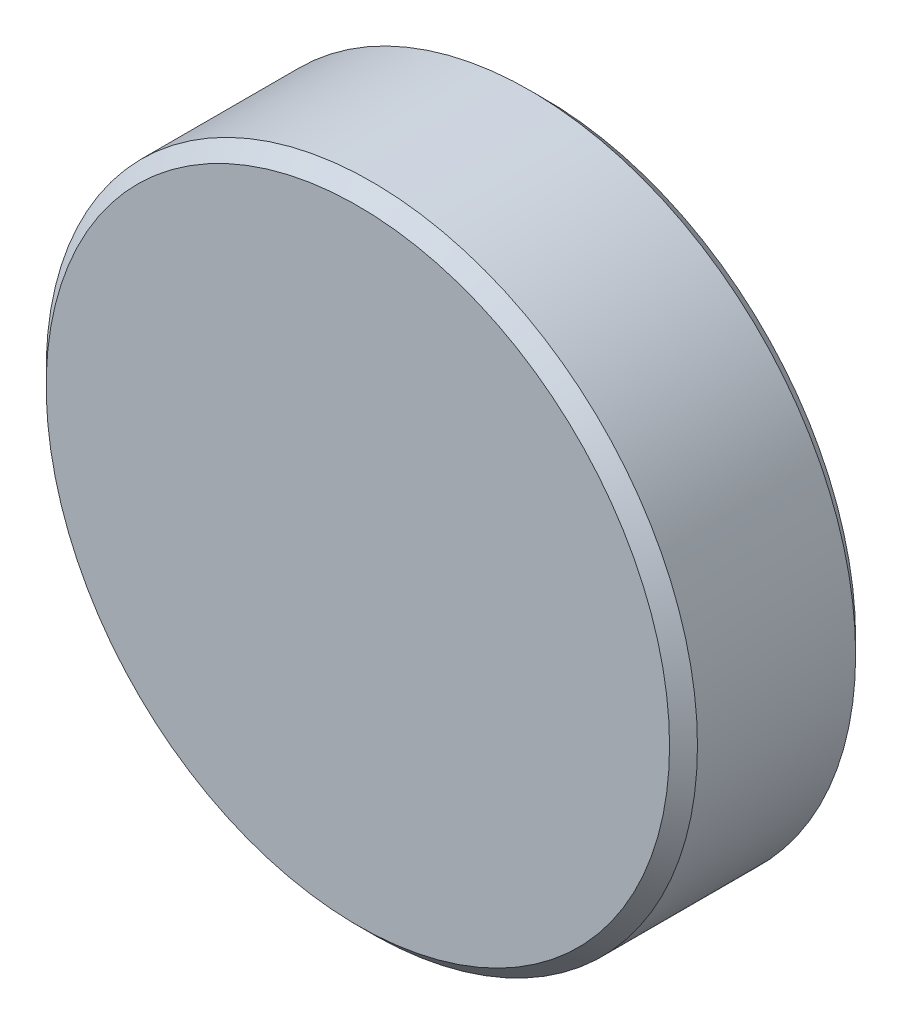
ISO-10303-21;
HEADER;
FILE_DESCRIPTION(('STEP AP214'),'2;1');
FILE_NAME('part.step','',(''),(''),'','','');
FILE_SCHEMA(('AUTOMOTIVE_DESIGN { 1 0 10303 214 1 1 1 1 }'));
ENDSEC;
DATA;
#1=APPLICATION_CONTEXT('core data for automotive mechanical design processes');
#2=APPLICATION_PROTOCOL_DEFINITION('international standard','automotive_design',2000,#1);
#3=PRODUCT_CONTEXT('',#1,'mechanical');
#4=PRODUCT('Part','Part','',(#3));
#5=PRODUCT_RELATED_PRODUCT_CATEGORY('part','',(#4));
#6=PRODUCT_DEFINITION_FORMATION('','',#4);
#7=PRODUCT_DEFINITION_CONTEXT('part definition',#1,'design');
#8=PRODUCT_DEFINITION('design','',#6,#7);
#9=PRODUCT_DEFINITION_SHAPE('','',#8);
#10=(LENGTH_UNIT() NAMED_UNIT(*) SI_UNIT(.MILLI.,.METRE.));
#11=(NAMED_UNIT(*) PLANE_ANGLE_UNIT() SI_UNIT($,.RADIAN.));
#12=(NAMED_UNIT(*) SI_UNIT($,.STERADIAN.) SOLID_ANGLE_UNIT());
#13=UNCERTAINTY_MEASURE_WITH_UNIT(LENGTH_MEASURE(1.E-05),#10,'distance_accuracy_value','');
#14=(GEOMETRIC_REPRESENTATION_CONTEXT(3) GLOBAL_UNCERTAINTY_ASSIGNED_CONTEXT((#13)) GLOBAL_UNIT_ASSIGNED_CONTEXT((#10,
#11,#12)) REPRESENTATION_CONTEXT('',''));
#15=CARTESIAN_POINT('',(0.,0.,0.));
#16=DIRECTION('',(0.,0.,1.));
#17=DIRECTION('',(1.,0.,0.));
#18=AXIS2_PLACEMENT_3D('',#15,#16,#17);
#19=CARTESIAN_POINT('',(0.,0.,1.));
#20=DIRECTION('',(0.,0.,-1.));
#21=DIRECTION('',(-1.,0.,0.));
#22=AXIS2_PLACEMENT_3D('',#19,#20,#21);
#23=CYLINDRICAL_SURFACE('',#22,3.5);
#24=CARTESIAN_POINT('',(0.,0.,-0.850000000000001));
#25=DIRECTION('',(0.,0.,1.));
#26=DIRECTION('',(1.,0.,0.));
#27=AXIS2_PLACEMENT_3D('',#24,#25,#26);
#28=CIRCLE('',#27,3.5);
#29=CARTESIAN_POINT('',(3.5,0.,-0.850000000000001));
#30=VERTEX_POINT('',#29);
#31=EDGE_CURVE('E25',#30,#30,#28,.T.);
#32=ORIENTED_EDGE('',*,*,#31,.T.);
#33=EDGE_LOOP('',(#32));
#34=FACE_BOUND('',#33,.T.);
#35=CARTESIAN_POINT('',(0.,0.,0.849999999999998));
#36=DIRECTION('',(0.,0.,1.));
#37=DIRECTION('',(1.,0.,0.));
#38=AXIS2_PLACEMENT_3D('',#35,#36,#37);
#39=CIRCLE('',#38,3.5);
#40=CARTESIAN_POINT('',(3.5,0.,0.849999999999998));
#41=VERTEX_POINT('',#40);
#42=EDGE_CURVE('E29',#41,#41,#39,.F.);
#43=ORIENTED_EDGE('',*,*,#42,.T.);
#44=EDGE_LOOP('',(#43));
#45=FACE_BOUND('',#44,.T.);
#46=ADVANCED_FACE('F14',(#34,#45),#23,.T.);
#47=CARTESIAN_POINT('',(0.,0.,1.));
#48=DIRECTION('',(0.,0.,1.));
#49=DIRECTION('',(1.,0.,0.));
#50=AXIS2_PLACEMENT_3D('',#47,#48,#49);
#51=PLANE('',#50);
#52=CARTESIAN_POINT('',(0.,0.,1.));
#53=DIRECTION('',(0.,0.,1.));
#54=DIRECTION('',(1.,0.,0.));
#55=AXIS2_PLACEMENT_3D('',#52,#53,#54);
#56=CIRCLE('',#55,3.35);
#57=CARTESIAN_POINT('',(3.35,0.,1.));
#58=VERTEX_POINT('',#57);
#59=EDGE_CURVE('E10',#58,#58,#56,.T.);
#60=ORIENTED_EDGE('',*,*,#59,.T.);
#61=EDGE_LOOP('',(#60));
#62=FACE_BOUND('',#61,.T.);
#63=ADVANCED_FACE('F46',(#62),#51,.T.);
#64=CARTESIAN_POINT('',(0.,0.,-1.));
#65=DIRECTION('',(0.,0.,1.));
#66=DIRECTION('',(1.,0.,0.));
#67=AXIS2_PLACEMENT_3D('',#64,#65,#66);
#68=PLANE('',#67);
#69=CARTESIAN_POINT('',(0.,0.,-1.));
#70=DIRECTION('',(0.,0.,1.));
#71=DIRECTION('',(1.,0.,0.));
#72=AXIS2_PLACEMENT_3D('',#69,#70,#71);
#73=CIRCLE('',#72,3.35);
#74=CARTESIAN_POINT('',(3.35,0.,-1.));
#75=VERTEX_POINT('',#74);
#76=EDGE_CURVE('E21',#75,#75,#73,.F.);
#77=ORIENTED_EDGE('',*,*,#76,.T.);
#78=EDGE_LOOP('',(#77));
#79=FACE_BOUND('',#78,.T.);
#80=ADVANCED_FACE('F43',(#79),#68,.F.);
#81=CARTESIAN_POINT('',(0.,0.,-0.850000000000001));
#82=DIRECTION('',(0.,0.,1.));
#83=DIRECTION('',(1.,0.,0.));
#84=AXIS2_PLACEMENT_3D('',#81,#82,#83);
#85=CONICAL_SURFACE('',#84,3.5,0.78539816339745);
#86=ORIENTED_EDGE('',*,*,#76,.F.);
#87=EDGE_LOOP('',(#86));
#88=FACE_BOUND('',#87,.T.);
#89=ORIENTED_EDGE('',*,*,#31,.F.);
#90=EDGE_LOOP('',(#89));
#91=FACE_BOUND('',#90,.T.);
#92=ADVANCED_FACE('F38',(#88,#91),#85,.T.);
#93=CARTESIAN_POINT('',(0.,0.,1.));
#94=DIRECTION('',(0.,0.,-1.));
#95=DIRECTION('',(-1.,0.,0.));
#96=AXIS2_PLACEMENT_3D('',#93,#94,#95);
#97=CONICAL_SURFACE('',#96,3.35,0.785398163397453);
#98=ORIENTED_EDGE('',*,*,#42,.F.);
#99=EDGE_LOOP('',(#98));
#100=FACE_BOUND('',#99,.T.);
#101=ORIENTED_EDGE('',*,*,#59,.F.);
#102=EDGE_LOOP('',(#101));
#103=FACE_BOUND('',#102,.T.);
#104=ADVANCED_FACE('F16',(#100,#103),#97,.T.);
#105=CLOSED_SHELL('',(#46,#63,#80,#92,#104));
#106=MANIFOLD_SOLID_BREP('B1',#105);
#107=ADVANCED_BREP_SHAPE_REPRESENTATION('',(#18,#106),#14);
#108=SHAPE_DEFINITION_REPRESENTATION(#9,#107);
ENDSEC;
END-ISO-10303-21;
